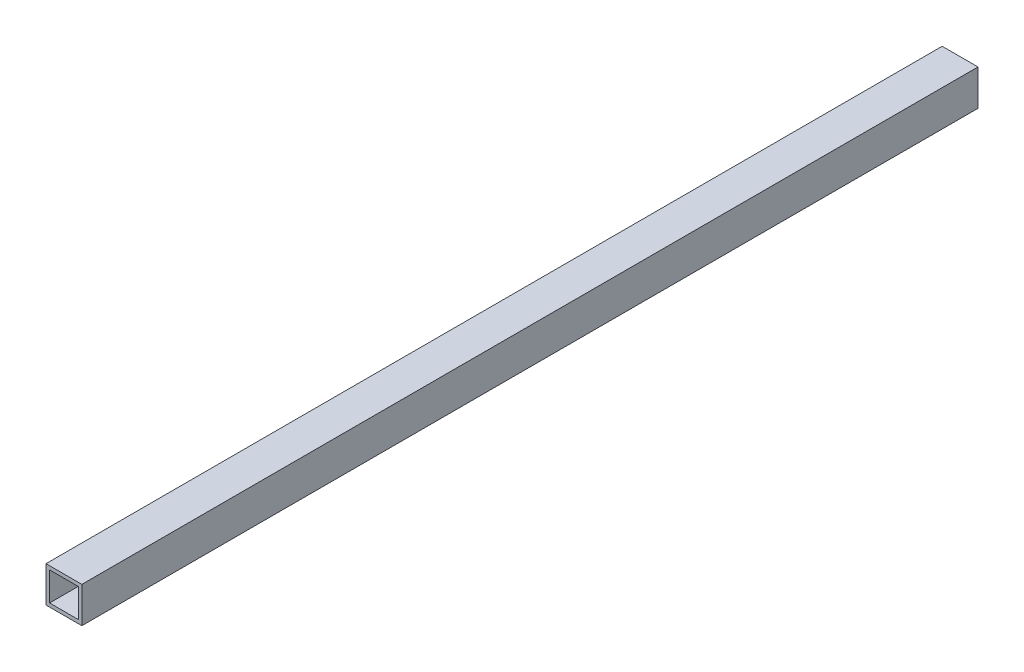
ISO-10303-21;
HEADER;
FILE_DESCRIPTION(('STEP AP214'),'2;1');
FILE_NAME('part.step','',(''),(''),'','','');
FILE_SCHEMA(('AUTOMOTIVE_DESIGN { 1 0 10303 214 1 1 1 1 }'));
ENDSEC;
DATA;
#1=APPLICATION_CONTEXT('core data for automotive mechanical design processes');
#2=APPLICATION_PROTOCOL_DEFINITION('international standard','automotive_design',2000,#1);
#3=PRODUCT_CONTEXT('',#1,'mechanical');
#4=PRODUCT('Part','Part','',(#3));
#5=PRODUCT_RELATED_PRODUCT_CATEGORY('part','',(#4));
#6=PRODUCT_DEFINITION_FORMATION('','',#4);
#7=PRODUCT_DEFINITION_CONTEXT('part definition',#1,'design');
#8=PRODUCT_DEFINITION('design','',#6,#7);
#9=PRODUCT_DEFINITION_SHAPE('','',#8);
#10=(LENGTH_UNIT() NAMED_UNIT(*) SI_UNIT(.MILLI.,.METRE.));
#11=(NAMED_UNIT(*) PLANE_ANGLE_UNIT() SI_UNIT($,.RADIAN.));
#12=(NAMED_UNIT(*) SI_UNIT($,.STERADIAN.) SOLID_ANGLE_UNIT());
#13=UNCERTAINTY_MEASURE_WITH_UNIT(LENGTH_MEASURE(1.E-05),#10,'distance_accuracy_value','');
#14=(GEOMETRIC_REPRESENTATION_CONTEXT(3) GLOBAL_UNCERTAINTY_ASSIGNED_CONTEXT((#13)) GLOBAL_UNIT_ASSIGNED_CONTEXT((#10,
#11,#12)) REPRESENTATION_CONTEXT('',''));
#15=CARTESIAN_POINT('',(0.,0.,0.));
#16=DIRECTION('',(0.,0.,1.));
#17=DIRECTION('',(1.,0.,0.));
#18=AXIS2_PLACEMENT_3D('',#15,#16,#17);
#19=CARTESIAN_POINT('',(-20.,20.,500.));
#20=DIRECTION('',(1.,0.,0.));
#21=DIRECTION('',(0.,0.,-1.));
#22=AXIS2_PLACEMENT_3D('',#19,#20,#21);
#23=PLANE('',#22);
#24=DIRECTION('',(0.,0.,-1.));
#25=VECTOR('',#24,1.);
#26=CARTESIAN_POINT('',(-20.,-20.,500.));
#27=LINE('',#26,#25);
#28=CARTESIAN_POINT('',(-20.,-20.,500.));
#29=VERTEX_POINT('',#28);
#30=CARTESIAN_POINT('',(-20.,-20.,-500.));
#31=VERTEX_POINT('',#30);
#32=EDGE_CURVE('E97',#29,#31,#27,.T.);
#33=ORIENTED_EDGE('',*,*,#32,.F.);
#34=DIRECTION('',(0.,-1.,0.));
#35=VECTOR('',#34,1.);
#36=CARTESIAN_POINT('',(-20.,20.,500.));
#37=LINE('',#36,#35);
#38=CARTESIAN_POINT('',(-20.,20.,500.));
#39=VERTEX_POINT('',#38);
#40=EDGE_CURVE('E86',#39,#29,#37,.T.);
#41=ORIENTED_EDGE('',*,*,#40,.F.);
#42=DIRECTION('',(0.,0.,-1.));
#43=VECTOR('',#42,1.);
#44=CARTESIAN_POINT('',(-20.,20.,500.));
#45=LINE('',#44,#43);
#46=CARTESIAN_POINT('',(-20.,20.,-500.));
#47=VERTEX_POINT('',#46);
#48=EDGE_CURVE('E102',#39,#47,#45,.T.);
#49=ORIENTED_EDGE('',*,*,#48,.T.);
#50=DIRECTION('',(0.,-1.,0.));
#51=VECTOR('',#50,1.);
#52=CARTESIAN_POINT('',(-20.,20.,-500.));
#53=LINE('',#52,#51);
#54=EDGE_CURVE('E98',#47,#31,#53,.T.);
#55=ORIENTED_EDGE('',*,*,#54,.T.);
#56=EDGE_LOOP('',(#33,#41,#49,#55));
#57=FACE_BOUND('',#56,.T.);
#58=ADVANCED_FACE('F34',(#57),#23,.F.);
#59=CARTESIAN_POINT('',(-20.,-20.,500.));
#60=DIRECTION('',(0.,1.,0.));
#61=DIRECTION('',(0.,0.,1.));
#62=AXIS2_PLACEMENT_3D('',#59,#60,#61);
#63=PLANE('',#62);
#64=DIRECTION('',(0.,0.,-1.));
#65=VECTOR('',#64,1.);
#66=CARTESIAN_POINT('',(20.,-20.,500.));
#67=LINE('',#66,#65);
#68=CARTESIAN_POINT('',(20.,-20.,500.));
#69=VERTEX_POINT('',#68);
#70=CARTESIAN_POINT('',(20.,-20.,-500.));
#71=VERTEX_POINT('',#70);
#72=EDGE_CURVE('E101',#69,#71,#67,.T.);
#73=ORIENTED_EDGE('',*,*,#72,.F.);
#74=DIRECTION('',(1.,0.,0.));
#75=VECTOR('',#74,1.);
#76=CARTESIAN_POINT('',(-20.,-20.,500.));
#77=LINE('',#76,#75);
#78=EDGE_CURVE('E83',#29,#69,#77,.T.);
#79=ORIENTED_EDGE('',*,*,#78,.F.);
#80=ORIENTED_EDGE('',*,*,#32,.T.);
#81=DIRECTION('',(1.,0.,0.));
#82=VECTOR('',#81,1.);
#83=CARTESIAN_POINT('',(-20.,-20.,-500.));
#84=LINE('',#83,#82);
#85=EDGE_CURVE('E124',#31,#71,#84,.T.);
#86=ORIENTED_EDGE('',*,*,#85,.T.);
#87=EDGE_LOOP('',(#73,#79,#80,#86));
#88=FACE_BOUND('',#87,.T.);
#89=ADVANCED_FACE('F104',(#88),#63,.F.);
#90=CARTESIAN_POINT('',(20.,20.,500.));
#91=DIRECTION('',(-1.,0.,0.));
#92=DIRECTION('',(0.,0.,1.));
#93=AXIS2_PLACEMENT_3D('',#90,#91,#92);
#94=PLANE('',#93);
#95=DIRECTION('',(0.,0.,-1.));
#96=VECTOR('',#95,1.);
#97=CARTESIAN_POINT('',(20.,20.,500.));
#98=LINE('',#97,#96);
#99=CARTESIAN_POINT('',(20.,20.,500.));
#100=VERTEX_POINT('',#99);
#101=CARTESIAN_POINT('',(20.,20.,-500.));
#102=VERTEX_POINT('',#101);
#103=EDGE_CURVE('E38',#100,#102,#98,.T.);
#104=ORIENTED_EDGE('',*,*,#103,.F.);
#105=DIRECTION('',(0.,1.,0.));
#106=VECTOR('',#105,1.);
#107=CARTESIAN_POINT('',(20.,20.,500.));
#108=LINE('',#107,#106);
#109=EDGE_CURVE('E107',#69,#100,#108,.T.);
#110=ORIENTED_EDGE('',*,*,#109,.F.);
#111=ORIENTED_EDGE('',*,*,#72,.T.);
#112=DIRECTION('',(0.,1.,0.));
#113=VECTOR('',#112,1.);
#114=CARTESIAN_POINT('',(20.,20.,-500.));
#115=LINE('',#114,#113);
#116=EDGE_CURVE('E111',#71,#102,#115,.T.);
#117=ORIENTED_EDGE('',*,*,#116,.T.);
#118=EDGE_LOOP('',(#104,#110,#111,#117));
#119=FACE_BOUND('',#118,.T.);
#120=ADVANCED_FACE('F122',(#119),#94,.F.);
#121=CARTESIAN_POINT('',(-20.,20.,500.));
#122=DIRECTION('',(0.,-1.,0.));
#123=DIRECTION('',(0.,0.,-1.));
#124=AXIS2_PLACEMENT_3D('',#121,#122,#123);
#125=PLANE('',#124);
#126=DIRECTION('',(-1.,0.,0.));
#127=VECTOR('',#126,1.);
#128=CARTESIAN_POINT('',(-20.,20.,-500.));
#129=LINE('',#128,#127);
#130=EDGE_CURVE('E121',#102,#47,#129,.T.);
#131=ORIENTED_EDGE('',*,*,#130,.T.);
#132=ORIENTED_EDGE('',*,*,#48,.F.);
#133=DIRECTION('',(-1.,0.,0.));
#134=VECTOR('',#133,1.);
#135=CARTESIAN_POINT('',(-20.,20.,500.));
#136=LINE('',#135,#134);
#137=EDGE_CURVE('E90',#100,#39,#136,.T.);
#138=ORIENTED_EDGE('',*,*,#137,.F.);
#139=ORIENTED_EDGE('',*,*,#103,.T.);
#140=EDGE_LOOP('',(#131,#132,#138,#139));
#141=FACE_BOUND('',#140,.T.);
#142=ADVANCED_FACE('F36',(#141),#125,.F.);
#143=CARTESIAN_POINT('',(0.,0.,500.));
#144=DIRECTION('',(0.,0.,1.));
#145=DIRECTION('',(1.,0.,0.));
#146=AXIS2_PLACEMENT_3D('',#143,#144,#145);
#147=PLANE('',#146);
#148=DIRECTION('',(0.,-1.,0.));
#149=VECTOR('',#148,1.);
#150=CARTESIAN_POINT('',(-16.,16.,500.));
#151=LINE('',#150,#149);
#152=CARTESIAN_POINT('',(-16.,-16.,500.));
#153=VERTEX_POINT('',#152);
#154=CARTESIAN_POINT('',(-16.,16.,500.));
#155=VERTEX_POINT('',#154);
#156=EDGE_CURVE('E129',#153,#155,#151,.F.);
#157=ORIENTED_EDGE('',*,*,#156,.T.);
#158=DIRECTION('',(-1.,0.,0.));
#159=VECTOR('',#158,1.);
#160=CARTESIAN_POINT('',(-16.,16.,500.));
#161=LINE('',#160,#159);
#162=CARTESIAN_POINT('',(16.,16.,500.));
#163=VERTEX_POINT('',#162);
#164=EDGE_CURVE('E125',#155,#163,#161,.F.);
#165=ORIENTED_EDGE('',*,*,#164,.T.);
#166=DIRECTION('',(0.,1.,0.));
#167=VECTOR('',#166,1.);
#168=CARTESIAN_POINT('',(16.,16.,500.));
#169=LINE('',#168,#167);
#170=CARTESIAN_POINT('',(16.,-16.,500.));
#171=VERTEX_POINT('',#170);
#172=EDGE_CURVE('E143',#163,#171,#169,.F.);
#173=ORIENTED_EDGE('',*,*,#172,.T.);
#174=DIRECTION('',(1.,0.,0.));
#175=VECTOR('',#174,1.);
#176=CARTESIAN_POINT('',(-16.,-16.,500.));
#177=LINE('',#176,#175);
#178=EDGE_CURVE('E133',#171,#153,#177,.F.);
#179=ORIENTED_EDGE('',*,*,#178,.T.);
#180=EDGE_LOOP('',(#157,#165,#173,#179));
#181=FACE_BOUND('',#180,.T.);
#182=ORIENTED_EDGE('',*,*,#40,.T.);
#183=ORIENTED_EDGE('',*,*,#78,.T.);
#184=ORIENTED_EDGE('',*,*,#109,.T.);
#185=ORIENTED_EDGE('',*,*,#137,.T.);
#186=EDGE_LOOP('',(#182,#183,#184,#185));
#187=FACE_BOUND('',#186,.T.);
#188=ADVANCED_FACE('F88',(#181,#187),#147,.T.);
#189=CARTESIAN_POINT('',(0.,0.,-500.));
#190=DIRECTION('',(0.,0.,1.));
#191=DIRECTION('',(1.,0.,0.));
#192=AXIS2_PLACEMENT_3D('',#189,#190,#191);
#193=PLANE('',#192);
#194=DIRECTION('',(0.,-1.,0.));
#195=VECTOR('',#194,1.);
#196=CARTESIAN_POINT('',(-16.,16.,-500.));
#197=LINE('',#196,#195);
#198=CARTESIAN_POINT('',(-16.,-16.,-500.));
#199=VERTEX_POINT('',#198);
#200=CARTESIAN_POINT('',(-16.,16.,-500.));
#201=VERTEX_POINT('',#200);
#202=EDGE_CURVE('E11',#199,#201,#197,.F.);
#203=ORIENTED_EDGE('',*,*,#202,.F.);
#204=DIRECTION('',(1.,0.,0.));
#205=VECTOR('',#204,1.);
#206=CARTESIAN_POINT('',(-16.,-16.,-500.));
#207=LINE('',#206,#205);
#208=CARTESIAN_POINT('',(16.,-16.,-500.));
#209=VERTEX_POINT('',#208);
#210=EDGE_CURVE('E44',#209,#199,#207,.F.);
#211=ORIENTED_EDGE('',*,*,#210,.F.);
#212=DIRECTION('',(0.,1.,0.));
#213=VECTOR('',#212,1.);
#214=CARTESIAN_POINT('',(16.,16.,-500.));
#215=LINE('',#214,#213);
#216=CARTESIAN_POINT('',(16.,16.,-500.));
#217=VERTEX_POINT('',#216);
#218=EDGE_CURVE('E140',#217,#209,#215,.F.);
#219=ORIENTED_EDGE('',*,*,#218,.F.);
#220=DIRECTION('',(-1.,0.,0.));
#221=VECTOR('',#220,1.);
#222=CARTESIAN_POINT('',(-16.,16.,-500.));
#223=LINE('',#222,#221);
#224=EDGE_CURVE('E137',#201,#217,#223,.F.);
#225=ORIENTED_EDGE('',*,*,#224,.F.);
#226=EDGE_LOOP('',(#203,#211,#219,#225));
#227=FACE_BOUND('',#226,.T.);
#228=ORIENTED_EDGE('',*,*,#54,.F.);
#229=ORIENTED_EDGE('',*,*,#130,.F.);
#230=ORIENTED_EDGE('',*,*,#116,.F.);
#231=ORIENTED_EDGE('',*,*,#85,.F.);
#232=EDGE_LOOP('',(#228,#229,#230,#231));
#233=FACE_BOUND('',#232,.T.);
#234=ADVANCED_FACE('F190',(#227,#233),#193,.F.);
#235=CARTESIAN_POINT('',(-16.,16.,500.));
#236=DIRECTION('',(0.,1.,0.));
#237=DIRECTION('',(0.,0.,1.));
#238=AXIS2_PLACEMENT_3D('',#235,#236,#237);
#239=PLANE('',#238);
#240=DIRECTION('',(0.,0.,-1.));
#241=VECTOR('',#240,1.);
#242=CARTESIAN_POINT('',(16.,16.,500.));
#243=LINE('',#242,#241);
#244=EDGE_CURVE('E145',#163,#217,#243,.T.);
#245=ORIENTED_EDGE('',*,*,#244,.F.);
#246=ORIENTED_EDGE('',*,*,#164,.F.);
#247=DIRECTION('',(0.,0.,-1.));
#248=VECTOR('',#247,1.);
#249=CARTESIAN_POINT('',(-16.,16.,500.));
#250=LINE('',#249,#248);
#251=EDGE_CURVE('E132',#155,#201,#250,.T.);
#252=ORIENTED_EDGE('',*,*,#251,.T.);
#253=ORIENTED_EDGE('',*,*,#224,.T.);
#254=EDGE_LOOP('',(#245,#246,#252,#253));
#255=FACE_BOUND('',#254,.T.);
#256=ADVANCED_FACE('F167',(#255),#239,.F.);
#257=CARTESIAN_POINT('',(16.,16.,500.));
#258=DIRECTION('',(1.,0.,0.));
#259=DIRECTION('',(0.,0.,-1.));
#260=AXIS2_PLACEMENT_3D('',#257,#258,#259);
#261=PLANE('',#260);
#262=DIRECTION('',(0.,0.,-1.));
#263=VECTOR('',#262,1.);
#264=CARTESIAN_POINT('',(16.,-16.,500.));
#265=LINE('',#264,#263);
#266=EDGE_CURVE('E138',#171,#209,#265,.T.);
#267=ORIENTED_EDGE('',*,*,#266,.F.);
#268=ORIENTED_EDGE('',*,*,#172,.F.);
#269=ORIENTED_EDGE('',*,*,#244,.T.);
#270=ORIENTED_EDGE('',*,*,#218,.T.);
#271=EDGE_LOOP('',(#267,#268,#269,#270));
#272=FACE_BOUND('',#271,.T.);
#273=ADVANCED_FACE('F171',(#272),#261,.F.);
#274=CARTESIAN_POINT('',(-16.,-16.,500.));
#275=DIRECTION('',(0.,-1.,0.));
#276=DIRECTION('',(0.,0.,-1.));
#277=AXIS2_PLACEMENT_3D('',#274,#275,#276);
#278=PLANE('',#277);
#279=DIRECTION('',(0.,0.,-1.));
#280=VECTOR('',#279,1.);
#281=CARTESIAN_POINT('',(-16.,-16.,500.));
#282=LINE('',#281,#280);
#283=EDGE_CURVE('E134',#153,#199,#282,.T.);
#284=ORIENTED_EDGE('',*,*,#283,.F.);
#285=ORIENTED_EDGE('',*,*,#178,.F.);
#286=ORIENTED_EDGE('',*,*,#266,.T.);
#287=ORIENTED_EDGE('',*,*,#210,.T.);
#288=EDGE_LOOP('',(#284,#285,#286,#287));
#289=FACE_BOUND('',#288,.T.);
#290=ADVANCED_FACE('F179',(#289),#278,.F.);
#291=CARTESIAN_POINT('',(-16.,16.,500.));
#292=DIRECTION('',(-1.,0.,0.));
#293=DIRECTION('',(0.,0.,1.));
#294=AXIS2_PLACEMENT_3D('',#291,#292,#293);
#295=PLANE('',#294);
#296=ORIENTED_EDGE('',*,*,#202,.T.);
#297=ORIENTED_EDGE('',*,*,#251,.F.);
#298=ORIENTED_EDGE('',*,*,#156,.F.);
#299=ORIENTED_EDGE('',*,*,#283,.T.);
#300=EDGE_LOOP('',(#296,#297,#298,#299));
#301=FACE_BOUND('',#300,.T.);
#302=ADVANCED_FACE('F178',(#301),#295,.F.);
#303=CLOSED_SHELL('',(#58,#89,#120,#142,#188,#234,#256,#273,#290,#302));
#304=MANIFOLD_SOLID_BREP('B2',#303);
#305=ADVANCED_BREP_SHAPE_REPRESENTATION('',(#18,#304),#14);
#306=SHAPE_DEFINITION_REPRESENTATION(#9,#305);
ENDSEC;
END-ISO-10303-21;
